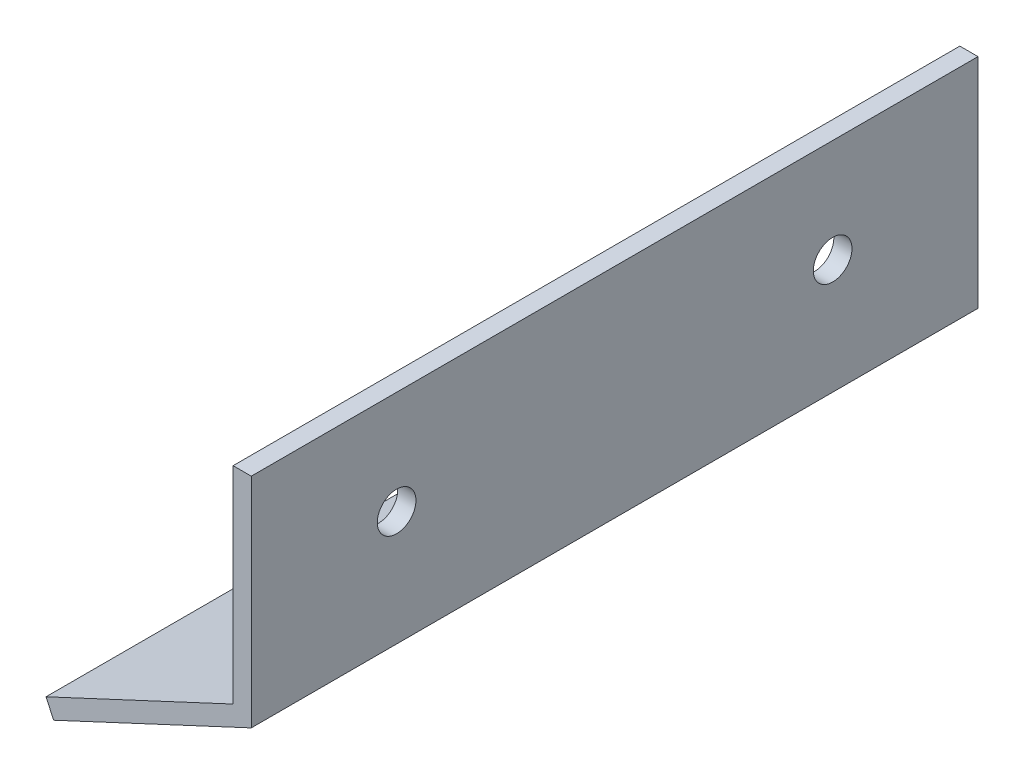
ISO-10303-21;
HEADER;
FILE_DESCRIPTION(('STEP AP214'),'2;1');
FILE_NAME('part.step','',(''),(''),'','','');
FILE_SCHEMA(('AUTOMOTIVE_DESIGN { 1 0 10303 214 1 1 1 1 }'));
ENDSEC;
DATA;
#1=APPLICATION_CONTEXT('core data for automotive mechanical design processes');
#2=APPLICATION_PROTOCOL_DEFINITION('international standard','automotive_design',2000,#1);
#3=PRODUCT_CONTEXT('',#1,'mechanical');
#4=PRODUCT('Part','Part','',(#3));
#5=PRODUCT_RELATED_PRODUCT_CATEGORY('part','',(#4));
#6=PRODUCT_DEFINITION_FORMATION('','',#4);
#7=PRODUCT_DEFINITION_CONTEXT('part definition',#1,'design');
#8=PRODUCT_DEFINITION('design','',#6,#7);
#9=PRODUCT_DEFINITION_SHAPE('','',#8);
#10=(LENGTH_UNIT() NAMED_UNIT(*) SI_UNIT(.MILLI.,.METRE.));
#11=(NAMED_UNIT(*) PLANE_ANGLE_UNIT() SI_UNIT($,.RADIAN.));
#12=(NAMED_UNIT(*) SI_UNIT($,.STERADIAN.) SOLID_ANGLE_UNIT());
#13=UNCERTAINTY_MEASURE_WITH_UNIT(LENGTH_MEASURE(1.E-05),#10,'distance_accuracy_value','');
#14=(GEOMETRIC_REPRESENTATION_CONTEXT(3) GLOBAL_UNCERTAINTY_ASSIGNED_CONTEXT((#13)) GLOBAL_UNIT_ASSIGNED_CONTEXT((#10,
#11,#12)) REPRESENTATION_CONTEXT('',''));
#15=CARTESIAN_POINT('',(0.,0.,0.));
#16=DIRECTION('',(0.,0.,1.));
#17=DIRECTION('',(1.,0.,0.));
#18=AXIS2_PLACEMENT_3D('',#15,#16,#17);
#19=CARTESIAN_POINT('',(-3.175,2.02269807806378,63.5));
#20=DIRECTION('',(1.,0.,0.));
#21=DIRECTION('',(0.,0.,-1.));
#22=AXIS2_PLACEMENT_3D('',#19,#20,#21);
#23=PLANE('',#22);
#24=CARTESIAN_POINT('',(-3.175,20.0613490390319,38.1));
#25=DIRECTION('',(-1.,0.,0.));
#26=DIRECTION('',(0.,0.,1.));
#27=AXIS2_PLACEMENT_3D('',#24,#25,#26);
#28=CIRCLE('',#27,3.3782);
#29=CARTESIAN_POINT('',(-3.175,20.0613490390319,41.4782));
#30=VERTEX_POINT('',#29);
#31=EDGE_CURVE('E203',#30,#30,#28,.T.);
#32=ORIENTED_EDGE('',*,*,#31,.F.);
#33=EDGE_LOOP('',(#32));
#34=FACE_BOUND('',#33,.T.);
#35=DIRECTION('',(0.,-1.,0.));
#36=VECTOR('',#35,1.);
#37=CARTESIAN_POINT('',(-3.175,2.02269807806378,-63.5));
#38=LINE('',#37,#36);
#39=CARTESIAN_POINT('',(-3.175,38.1,-63.5));
#40=VERTEX_POINT('',#39);
#41=CARTESIAN_POINT('',(-3.175,2.02269807806378,-63.5));
#42=VERTEX_POINT('',#41);
#43=EDGE_CURVE('E120',#40,#42,#38,.T.);
#44=ORIENTED_EDGE('',*,*,#43,.T.);
#45=DIRECTION('',(0.,0.,-1.));
#46=VECTOR('',#45,1.);
#47=CARTESIAN_POINT('',(-3.175,2.02269807806378,63.5));
#48=LINE('',#47,#46);
#49=CARTESIAN_POINT('',(-3.175,2.02269807806378,63.5));
#50=VERTEX_POINT('',#49);
#51=EDGE_CURVE('E117',#50,#42,#48,.T.);
#52=ORIENTED_EDGE('',*,*,#51,.F.);
#53=DIRECTION('',(0.,-1.,0.));
#54=VECTOR('',#53,1.);
#55=CARTESIAN_POINT('',(-3.175,2.02269807806378,63.5));
#56=LINE('',#55,#54);
#57=CARTESIAN_POINT('',(-3.175,38.1,63.5));
#58=VERTEX_POINT('',#57);
#59=EDGE_CURVE('E105',#58,#50,#56,.T.);
#60=ORIENTED_EDGE('',*,*,#59,.F.);
#61=DIRECTION('',(0.,0.,-1.));
#62=VECTOR('',#61,1.);
#63=CARTESIAN_POINT('',(-3.175,38.1,63.5));
#64=LINE('',#63,#62);
#65=EDGE_CURVE('E122',#58,#40,#64,.T.);
#66=ORIENTED_EDGE('',*,*,#65,.T.);
#67=EDGE_LOOP('',(#44,#52,#60,#66));
#68=FACE_BOUND('',#67,.T.);
#69=CARTESIAN_POINT('',(-3.175,20.0613490390319,-38.1));
#70=DIRECTION('',(-1.,0.,0.));
#71=DIRECTION('',(0.,0.,1.));
#72=AXIS2_PLACEMENT_3D('',#69,#70,#71);
#73=CIRCLE('',#72,3.3782);
#74=CARTESIAN_POINT('',(-3.175,20.0613490390319,-34.7218));
#75=VERTEX_POINT('',#74);
#76=EDGE_CURVE('E254',#75,#75,#73,.T.);
#77=ORIENTED_EDGE('',*,*,#76,.F.);
#78=EDGE_LOOP('',(#77));
#79=FACE_BOUND('',#78,.T.);
#80=ADVANCED_FACE('F43',(#34,#68,#79),#23,.F.);
#81=CARTESIAN_POINT('',(0.,0.,63.5));
#82=DIRECTION('',(-0.422618261740704,0.906307787036648,0.));
#83=DIRECTION('',(-0.906307787036648,-0.422618261740704,0.));
#84=AXIS2_PLACEMENT_3D('',#81,#82,#83);
#85=PLANE('',#84);
#86=CARTESIAN_POINT('',(-18.1817568525348,-8.4782924590492,-38.1));
#87=DIRECTION('',(-0.422618261740704,0.906307787036648,0.));
#88=DIRECTION('',(-0.906307787036648,-0.422618261740704,0.));
#89=AXIS2_PLACEMENT_3D('',#86,#87,#88);
#90=CIRCLE('',#89,3.3782);
#91=CARTESIAN_POINT('',(-21.243445818702,-9.90598147086165,-38.1));
#92=VERTEX_POINT('',#91);
#93=EDGE_CURVE('E208',#92,#92,#90,.T.);
#94=ORIENTED_EDGE('',*,*,#93,.T.);
#95=EDGE_LOOP('',(#94));
#96=FACE_BOUND('',#95,.T.);
#97=CARTESIAN_POINT('',(-18.1817568525348,-8.4782924590492,38.1));
#98=DIRECTION('',(-0.422618261740704,0.906307787036648,0.));
#99=DIRECTION('',(-0.906307787036648,-0.422618261740704,0.));
#100=AXIS2_PLACEMENT_3D('',#97,#98,#99);
#101=CIRCLE('',#100,3.3782);
#102=CARTESIAN_POINT('',(-21.243445818702,-9.90598147086164,38.1));
#103=VERTEX_POINT('',#102);
#104=EDGE_CURVE('E138',#103,#103,#101,.T.);
#105=ORIENTED_EDGE('',*,*,#104,.T.);
#106=EDGE_LOOP('',(#105));
#107=FACE_BOUND('',#106,.T.);
#108=DIRECTION('',(0.906307787036648,0.422618261740704,0.));
#109=VECTOR('',#108,1.);
#110=CARTESIAN_POINT('',(0.,0.,-63.5));
#111=LINE('',#110,#109);
#112=CARTESIAN_POINT('',(-34.5303266860963,-16.1017557723208,-63.5));
#113=VERTEX_POINT('',#112);
#114=CARTESIAN_POINT('',(0.,0.,-63.5));
#115=VERTEX_POINT('',#114);
#116=EDGE_CURVE('E133',#113,#115,#111,.T.);
#117=ORIENTED_EDGE('',*,*,#116,.T.);
#118=DIRECTION('',(0.,0.,-1.));
#119=VECTOR('',#118,1.);
#120=CARTESIAN_POINT('',(0.,0.,63.5));
#121=LINE('',#120,#119);
#122=CARTESIAN_POINT('',(0.,0.,63.5));
#123=VERTEX_POINT('',#122);
#124=EDGE_CURVE('E11',#123,#115,#121,.T.);
#125=ORIENTED_EDGE('',*,*,#124,.F.);
#126=DIRECTION('',(0.906307787036648,0.422618261740704,0.));
#127=VECTOR('',#126,1.);
#128=CARTESIAN_POINT('',(0.,0.,63.5));
#129=LINE('',#128,#127);
#130=CARTESIAN_POINT('',(-34.5303266860963,-16.1017557723208,63.5));
#131=VERTEX_POINT('',#130);
#132=EDGE_CURVE('E150',#131,#123,#129,.T.);
#133=ORIENTED_EDGE('',*,*,#132,.F.);
#134=DIRECTION('',(0.,0.,-1.));
#135=VECTOR('',#134,1.);
#136=CARTESIAN_POINT('',(-34.5303266860963,-16.1017557723208,63.5));
#137=LINE('',#136,#135);
#138=EDGE_CURVE('E129',#131,#113,#137,.T.);
#139=ORIENTED_EDGE('',*,*,#138,.T.);
#140=EDGE_LOOP('',(#117,#125,#133,#139));
#141=FACE_BOUND('',#140,.T.);
#142=ADVANCED_FACE('F45',(#96,#107,#141),#85,.F.);
#143=CARTESIAN_POINT('',(0.,0.,63.5));
#144=DIRECTION('',(-1.,0.,0.));
#145=DIRECTION('',(0.,0.,1.));
#146=AXIS2_PLACEMENT_3D('',#143,#144,#145);
#147=PLANE('',#146);
#148=CARTESIAN_POINT('',(0.,20.0613490390319,-38.1));
#149=DIRECTION('',(-1.,0.,0.));
#150=DIRECTION('',(0.,0.,1.));
#151=AXIS2_PLACEMENT_3D('',#148,#149,#150);
#152=CIRCLE('',#151,3.3782);
#153=CARTESIAN_POINT('',(0.,20.0613490390319,-34.7218));
#154=VERTEX_POINT('',#153);
#155=EDGE_CURVE('E196',#154,#154,#152,.T.);
#156=ORIENTED_EDGE('',*,*,#155,.T.);
#157=EDGE_LOOP('',(#156));
#158=FACE_BOUND('',#157,.T.);
#159=CARTESIAN_POINT('',(0.,20.0613490390319,38.1));
#160=DIRECTION('',(-1.,0.,0.));
#161=DIRECTION('',(0.,0.,1.));
#162=AXIS2_PLACEMENT_3D('',#159,#160,#161);
#163=CIRCLE('',#162,3.3782);
#164=CARTESIAN_POINT('',(0.,20.0613490390319,41.4782));
#165=VERTEX_POINT('',#164);
#166=EDGE_CURVE('E199',#165,#165,#163,.T.);
#167=ORIENTED_EDGE('',*,*,#166,.T.);
#168=EDGE_LOOP('',(#167));
#169=FACE_BOUND('',#168,.T.);
#170=DIRECTION('',(0.,1.,0.));
#171=VECTOR('',#170,1.);
#172=CARTESIAN_POINT('',(0.,0.,-63.5));
#173=LINE('',#172,#171);
#174=CARTESIAN_POINT('',(0.,38.1,-63.5));
#175=VERTEX_POINT('',#174);
#176=EDGE_CURVE('E137',#115,#175,#173,.T.);
#177=ORIENTED_EDGE('',*,*,#176,.T.);
#178=DIRECTION('',(0.,0.,-1.));
#179=VECTOR('',#178,1.);
#180=CARTESIAN_POINT('',(0.,38.1,63.5));
#181=LINE('',#180,#179);
#182=CARTESIAN_POINT('',(0.,38.1,63.5));
#183=VERTEX_POINT('',#182);
#184=EDGE_CURVE('E53',#183,#175,#181,.T.);
#185=ORIENTED_EDGE('',*,*,#184,.F.);
#186=DIRECTION('',(0.,1.,0.));
#187=VECTOR('',#186,1.);
#188=CARTESIAN_POINT('',(0.,0.,63.5));
#189=LINE('',#188,#187);
#190=EDGE_CURVE('E98',#123,#183,#189,.T.);
#191=ORIENTED_EDGE('',*,*,#190,.F.);
#192=ORIENTED_EDGE('',*,*,#124,.T.);
#193=EDGE_LOOP('',(#177,#185,#191,#192));
#194=FACE_BOUND('',#193,.T.);
#195=ADVANCED_FACE('F184',(#158,#169,#194),#147,.F.);
#196=CARTESIAN_POINT('',(-3.175,38.1,63.5));
#197=DIRECTION('',(0.,-1.,0.));
#198=DIRECTION('',(0.,0.,-1.));
#199=AXIS2_PLACEMENT_3D('',#196,#197,#198);
#200=PLANE('',#199);
#201=DIRECTION('',(-1.,0.,0.));
#202=VECTOR('',#201,1.);
#203=CARTESIAN_POINT('',(-3.175,38.1,-63.5));
#204=LINE('',#203,#202);
#205=EDGE_CURVE('E141',#175,#40,#204,.T.);
#206=ORIENTED_EDGE('',*,*,#205,.T.);
#207=ORIENTED_EDGE('',*,*,#65,.F.);
#208=DIRECTION('',(-1.,0.,0.));
#209=VECTOR('',#208,1.);
#210=CARTESIAN_POINT('',(-3.175,38.1,63.5));
#211=LINE('',#210,#209);
#212=EDGE_CURVE('E111',#183,#58,#211,.T.);
#213=ORIENTED_EDGE('',*,*,#212,.F.);
#214=ORIENTED_EDGE('',*,*,#184,.T.);
#215=EDGE_LOOP('',(#206,#207,#213,#214));
#216=FACE_BOUND('',#215,.T.);
#217=ADVANCED_FACE('F160',(#216),#200,.F.);
#218=CARTESIAN_POINT('',(-3.175,2.02269807806378,63.5));
#219=DIRECTION('',(0.422618261740704,-0.906307787036648,0.));
#220=DIRECTION('',(0.906307787036648,0.422618261740704,0.));
#221=AXIS2_PLACEMENT_3D('',#218,#219,#220);
#222=PLANE('',#221);
#223=CARTESIAN_POINT('',(-19.5235698335615,-5.60076523520785,-38.1));
#224=DIRECTION('',(-0.422618261740704,0.906307787036648,0.));
#225=DIRECTION('',(-0.906307787036648,-0.422618261740704,0.));
#226=AXIS2_PLACEMENT_3D('',#223,#224,#225);
#227=CIRCLE('',#226,3.3782);
#228=CARTESIAN_POINT('',(-22.5852587997287,-7.02845424702029,-38.1));
#229=VERTEX_POINT('',#228);
#230=EDGE_CURVE('E202',#229,#229,#227,.T.);
#231=ORIENTED_EDGE('',*,*,#230,.F.);
#232=EDGE_LOOP('',(#231));
#233=FACE_BOUND('',#232,.T.);
#234=CARTESIAN_POINT('',(-19.5235698335615,-5.60076523520784,38.1));
#235=DIRECTION('',(-0.422618261740704,0.906307787036648,0.));
#236=DIRECTION('',(-0.906307787036648,-0.422618261740704,0.));
#237=AXIS2_PLACEMENT_3D('',#234,#235,#236);
#238=CIRCLE('',#237,3.3782);
#239=CARTESIAN_POINT('',(-22.5852587997287,-7.02845424702029,38.1));
#240=VERTEX_POINT('',#239);
#241=EDGE_CURVE('E217',#240,#240,#238,.T.);
#242=ORIENTED_EDGE('',*,*,#241,.F.);
#243=EDGE_LOOP('',(#242));
#244=FACE_BOUND('',#243,.T.);
#245=DIRECTION('',(-0.906307787036648,-0.422618261740704,0.));
#246=VECTOR('',#245,1.);
#247=CARTESIAN_POINT('',(-3.175,2.02269807806378,-63.5));
#248=LINE('',#247,#246);
#249=CARTESIAN_POINT('',(-35.872139667123,-13.2242285484795,-63.5));
#250=VERTEX_POINT('',#249);
#251=EDGE_CURVE('E84',#42,#250,#248,.T.);
#252=ORIENTED_EDGE('',*,*,#251,.T.);
#253=DIRECTION('',(0.,0.,-1.));
#254=VECTOR('',#253,1.);
#255=CARTESIAN_POINT('',(-35.872139667123,-13.2242285484795,63.5));
#256=LINE('',#255,#254);
#257=CARTESIAN_POINT('',(-35.872139667123,-13.2242285484795,63.5));
#258=VERTEX_POINT('',#257);
#259=EDGE_CURVE('E123',#258,#250,#256,.T.);
#260=ORIENTED_EDGE('',*,*,#259,.F.);
#261=DIRECTION('',(-0.906307787036648,-0.422618261740704,0.));
#262=VECTOR('',#261,1.);
#263=CARTESIAN_POINT('',(-3.175,2.02269807806378,63.5));
#264=LINE('',#263,#262);
#265=EDGE_CURVE('E109',#50,#258,#264,.T.);
#266=ORIENTED_EDGE('',*,*,#265,.F.);
#267=ORIENTED_EDGE('',*,*,#51,.T.);
#268=EDGE_LOOP('',(#252,#260,#266,#267));
#269=FACE_BOUND('',#268,.T.);
#270=ADVANCED_FACE('F125',(#233,#244,#269),#222,.F.);
#271=CARTESIAN_POINT('',(-35.872139667123,-13.2242285484795,63.5));
#272=DIRECTION('',(0.906307787036647,0.422618261740705,0.));
#273=DIRECTION('',(-0.422618261740705,0.906307787036647,0.));
#274=AXIS2_PLACEMENT_3D('',#271,#272,#273);
#275=PLANE('',#274);
#276=DIRECTION('',(0.422618261740705,-0.906307787036647,0.));
#277=VECTOR('',#276,1.);
#278=CARTESIAN_POINT('',(-35.872139667123,-13.2242285484795,-63.5));
#279=LINE('',#278,#277);
#280=EDGE_CURVE('E90',#250,#113,#279,.T.);
#281=ORIENTED_EDGE('',*,*,#280,.T.);
#282=ORIENTED_EDGE('',*,*,#138,.F.);
#283=DIRECTION('',(0.422618261740705,-0.906307787036647,0.));
#284=VECTOR('',#283,1.);
#285=CARTESIAN_POINT('',(-35.872139667123,-13.2242285484795,63.5));
#286=LINE('',#285,#284);
#287=EDGE_CURVE('E61',#258,#131,#286,.T.);
#288=ORIENTED_EDGE('',*,*,#287,.F.);
#289=ORIENTED_EDGE('',*,*,#259,.T.);
#290=EDGE_LOOP('',(#281,#282,#288,#289));
#291=FACE_BOUND('',#290,.T.);
#292=ADVANCED_FACE('F167',(#291),#275,.F.);
#293=CARTESIAN_POINT('',(0.,0.,63.5));
#294=DIRECTION('',(0.,0.,1.));
#295=DIRECTION('',(1.,0.,0.));
#296=AXIS2_PLACEMENT_3D('',#293,#294,#295);
#297=PLANE('',#296);
#298=ORIENTED_EDGE('',*,*,#132,.T.);
#299=ORIENTED_EDGE('',*,*,#190,.T.);
#300=ORIENTED_EDGE('',*,*,#212,.T.);
#301=ORIENTED_EDGE('',*,*,#59,.T.);
#302=ORIENTED_EDGE('',*,*,#265,.T.);
#303=ORIENTED_EDGE('',*,*,#287,.T.);
#304=EDGE_LOOP('',(#298,#299,#300,#301,#302,#303));
#305=FACE_BOUND('',#304,.T.);
#306=ADVANCED_FACE('F107',(#305),#297,.T.);
#307=CARTESIAN_POINT('',(0.,0.,-63.5));
#308=DIRECTION('',(0.,0.,1.));
#309=DIRECTION('',(1.,0.,0.));
#310=AXIS2_PLACEMENT_3D('',#307,#308,#309);
#311=PLANE('',#310);
#312=ORIENTED_EDGE('',*,*,#116,.F.);
#313=ORIENTED_EDGE('',*,*,#280,.F.);
#314=ORIENTED_EDGE('',*,*,#251,.F.);
#315=ORIENTED_EDGE('',*,*,#43,.F.);
#316=ORIENTED_EDGE('',*,*,#205,.F.);
#317=ORIENTED_EDGE('',*,*,#176,.F.);
#318=EDGE_LOOP('',(#312,#313,#314,#315,#316,#317));
#319=FACE_BOUND('',#318,.T.);
#320=ADVANCED_FACE('F163',(#319),#311,.F.);
#321=CARTESIAN_POINT('',(-19.5235698335615,-5.60076523520784,38.1));
#322=DIRECTION('',(-0.422618261740704,0.906307787036648,0.));
#323=DIRECTION('',(-0.906307787036648,-0.422618261740704,0.));
#324=AXIS2_PLACEMENT_3D('',#321,#322,#323);
#325=CYLINDRICAL_SURFACE('',#324,3.3782);
#326=ORIENTED_EDGE('',*,*,#241,.T.);
#327=EDGE_LOOP('',(#326));
#328=FACE_BOUND('',#327,.T.);
#329=ORIENTED_EDGE('',*,*,#104,.F.);
#330=EDGE_LOOP('',(#329));
#331=FACE_BOUND('',#330,.T.);
#332=ADVANCED_FACE('F231',(#328,#331),#325,.F.);
#333=CARTESIAN_POINT('',(-19.5235698335615,-5.60076523520785,-38.1));
#334=DIRECTION('',(-0.422618261740704,0.906307787036648,0.));
#335=DIRECTION('',(-0.906307787036648,-0.422618261740704,0.));
#336=AXIS2_PLACEMENT_3D('',#333,#334,#335);
#337=CYLINDRICAL_SURFACE('',#336,3.3782);
#338=ORIENTED_EDGE('',*,*,#230,.T.);
#339=EDGE_LOOP('',(#338));
#340=FACE_BOUND('',#339,.T.);
#341=ORIENTED_EDGE('',*,*,#93,.F.);
#342=EDGE_LOOP('',(#341));
#343=FACE_BOUND('',#342,.T.);
#344=ADVANCED_FACE('F233',(#340,#343),#337,.F.);
#345=CARTESIAN_POINT('',(-3.175,20.0613490390319,38.1));
#346=DIRECTION('',(-1.,0.,0.));
#347=DIRECTION('',(0.,0.,1.));
#348=AXIS2_PLACEMENT_3D('',#345,#346,#347);
#349=CYLINDRICAL_SURFACE('',#348,3.3782);
#350=ORIENTED_EDGE('',*,*,#166,.F.);
#351=EDGE_LOOP('',(#350));
#352=FACE_BOUND('',#351,.T.);
#353=ORIENTED_EDGE('',*,*,#31,.T.);
#354=EDGE_LOOP('',(#353));
#355=FACE_BOUND('',#354,.T.);
#356=ADVANCED_FACE('F240',(#352,#355),#349,.F.);
#357=CARTESIAN_POINT('',(-3.175,20.0613490390319,-38.1));
#358=DIRECTION('',(-1.,0.,0.));
#359=DIRECTION('',(0.,0.,1.));
#360=AXIS2_PLACEMENT_3D('',#357,#358,#359);
#361=CYLINDRICAL_SURFACE('',#360,3.3782);
#362=ORIENTED_EDGE('',*,*,#155,.F.);
#363=EDGE_LOOP('',(#362));
#364=FACE_BOUND('',#363,.T.);
#365=ORIENTED_EDGE('',*,*,#76,.T.);
#366=EDGE_LOOP('',(#365));
#367=FACE_BOUND('',#366,.T.);
#368=ADVANCED_FACE('F246',(#364,#367),#361,.F.);
#369=CLOSED_SHELL('',(#80,#142,#195,#217,#270,#292,#306,#320,#332,#344,#356,#368));
#370=MANIFOLD_SOLID_BREP('B2',#369);
#371=ADVANCED_BREP_SHAPE_REPRESENTATION('',(#18,#370),#14);
#372=SHAPE_DEFINITION_REPRESENTATION(#9,#371);
ENDSEC;
END-ISO-10303-21;
